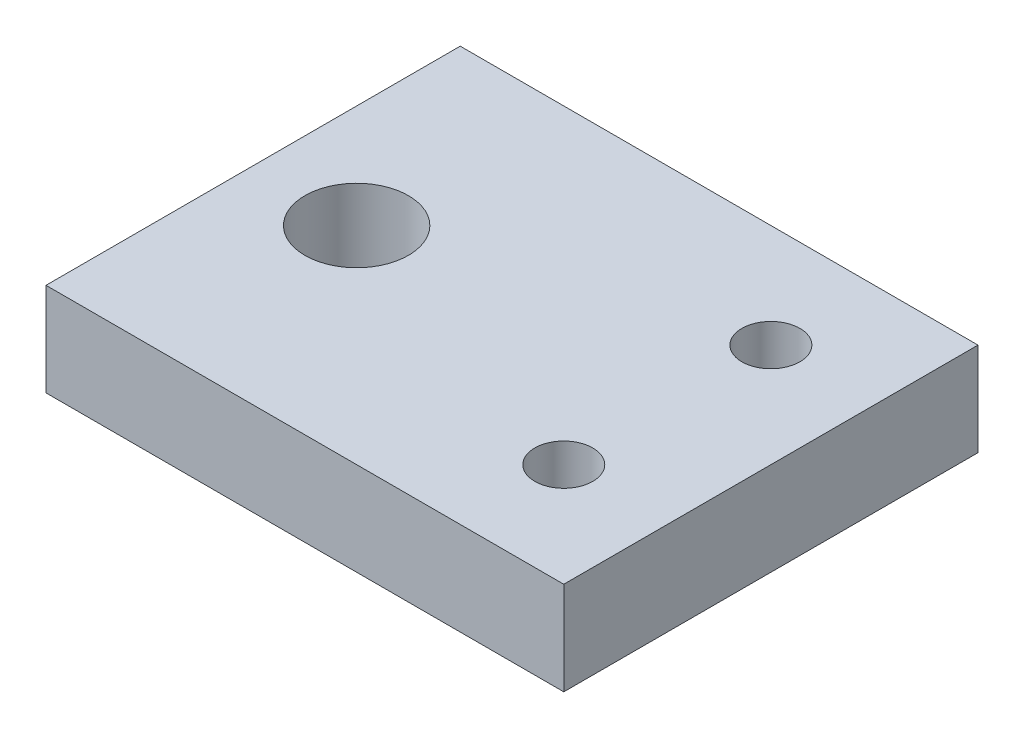
ISO-10303-21;
HEADER;
FILE_DESCRIPTION(('STEP AP214'),'2;1');
FILE_NAME('part.step','',(''),(''),'','','');
FILE_SCHEMA(('AUTOMOTIVE_DESIGN { 1 0 10303 214 1 1 1 1 }'));
ENDSEC;
DATA;
#1=APPLICATION_CONTEXT('core data for automotive mechanical design processes');
#2=APPLICATION_PROTOCOL_DEFINITION('international standard','automotive_design',2000,#1);
#3=PRODUCT_CONTEXT('',#1,'mechanical');
#4=PRODUCT('Part','Part','',(#3));
#5=PRODUCT_RELATED_PRODUCT_CATEGORY('part','',(#4));
#6=PRODUCT_DEFINITION_FORMATION('','',#4);
#7=PRODUCT_DEFINITION_CONTEXT('part definition',#1,'design');
#8=PRODUCT_DEFINITION('design','',#6,#7);
#9=PRODUCT_DEFINITION_SHAPE('','',#8);
#10=(LENGTH_UNIT() NAMED_UNIT(*) SI_UNIT(.MILLI.,.METRE.));
#11=(NAMED_UNIT(*) PLANE_ANGLE_UNIT() SI_UNIT($,.RADIAN.));
#12=(NAMED_UNIT(*) SI_UNIT($,.STERADIAN.) SOLID_ANGLE_UNIT());
#13=UNCERTAINTY_MEASURE_WITH_UNIT(LENGTH_MEASURE(1.E-05),#10,'distance_accuracy_value','');
#14=(GEOMETRIC_REPRESENTATION_CONTEXT(3) GLOBAL_UNCERTAINTY_ASSIGNED_CONTEXT((#13)) GLOBAL_UNIT_ASSIGNED_CONTEXT((#10,
#11,#12)) REPRESENTATION_CONTEXT('',''));
#15=CARTESIAN_POINT('',(0.,0.,0.));
#16=DIRECTION('',(0.,0.,1.));
#17=DIRECTION('',(1.,0.,0.));
#18=AXIS2_PLACEMENT_3D('',#15,#16,#17);
#19=CARTESIAN_POINT('',(0.,4.5,0.));
#20=DIRECTION('',(-1.,0.,0.));
#21=DIRECTION('',(0.,0.,1.));
#22=AXIS2_PLACEMENT_3D('',#19,#20,#21);
#23=PLANE('',#22);
#24=DIRECTION('',(0.,0.,-1.));
#25=VECTOR('',#24,1.);
#26=CARTESIAN_POINT('',(0.,0.,0.));
#27=LINE('',#26,#25);
#28=CARTESIAN_POINT('',(0.,0.,0.));
#29=VERTEX_POINT('',#28);
#30=CARTESIAN_POINT('',(0.,0.,-20.));
#31=VERTEX_POINT('',#30);
#32=EDGE_CURVE('E99',#29,#31,#27,.T.);
#33=ORIENTED_EDGE('',*,*,#32,.F.);
#34=DIRECTION('',(0.,-1.,0.));
#35=VECTOR('',#34,1.);
#36=CARTESIAN_POINT('',(0.,4.5,0.));
#37=LINE('',#36,#35);
#38=CARTESIAN_POINT('',(0.,4.5,0.));
#39=VERTEX_POINT('',#38);
#40=EDGE_CURVE('E11',#39,#29,#37,.T.);
#41=ORIENTED_EDGE('',*,*,#40,.F.);
#42=DIRECTION('',(0.,0.,-1.));
#43=VECTOR('',#42,1.);
#44=CARTESIAN_POINT('',(0.,4.5,0.));
#45=LINE('',#44,#43);
#46=CARTESIAN_POINT('',(0.,4.5,-20.));
#47=VERTEX_POINT('',#46);
#48=EDGE_CURVE('E93',#39,#47,#45,.T.);
#49=ORIENTED_EDGE('',*,*,#48,.T.);
#50=DIRECTION('',(0.,-1.,0.));
#51=VECTOR('',#50,1.);
#52=CARTESIAN_POINT('',(0.,4.5,-20.));
#53=LINE('',#52,#51);
#54=EDGE_CURVE('E36',#47,#31,#53,.T.);
#55=ORIENTED_EDGE('',*,*,#54,.T.);
#56=EDGE_LOOP('',(#33,#41,#49,#55));
#57=FACE_BOUND('',#56,.T.);
#58=ADVANCED_FACE('F33',(#57),#23,.T.);
#59=CARTESIAN_POINT('',(0.,4.5,0.));
#60=DIRECTION('',(0.,0.,-1.));
#61=DIRECTION('',(-1.,0.,0.));
#62=AXIS2_PLACEMENT_3D('',#59,#60,#61);
#63=PLANE('',#62);
#64=DIRECTION('',(1.,0.,0.));
#65=VECTOR('',#64,1.);
#66=CARTESIAN_POINT('',(0.,0.,0.));
#67=LINE('',#66,#65);
#68=CARTESIAN_POINT('',(25.,0.,0.));
#69=VERTEX_POINT('',#68);
#70=EDGE_CURVE('E66',#29,#69,#67,.T.);
#71=ORIENTED_EDGE('',*,*,#70,.T.);
#72=DIRECTION('',(0.,-1.,0.));
#73=VECTOR('',#72,1.);
#74=CARTESIAN_POINT('',(25.,4.5,0.));
#75=LINE('',#74,#73);
#76=CARTESIAN_POINT('',(25.,4.5,0.));
#77=VERTEX_POINT('',#76);
#78=EDGE_CURVE('E42',#77,#69,#75,.T.);
#79=ORIENTED_EDGE('',*,*,#78,.F.);
#80=DIRECTION('',(1.,0.,0.));
#81=VECTOR('',#80,1.);
#82=CARTESIAN_POINT('',(0.,4.5,0.));
#83=LINE('',#82,#81);
#84=EDGE_CURVE('E83',#39,#77,#83,.T.);
#85=ORIENTED_EDGE('',*,*,#84,.F.);
#86=ORIENTED_EDGE('',*,*,#40,.T.);
#87=EDGE_LOOP('',(#71,#79,#85,#86));
#88=FACE_BOUND('',#87,.T.);
#89=ADVANCED_FACE('F110',(#88),#63,.F.);
#90=CARTESIAN_POINT('',(25.,4.5,0.));
#91=DIRECTION('',(-1.,0.,0.));
#92=DIRECTION('',(0.,0.,1.));
#93=AXIS2_PLACEMENT_3D('',#90,#91,#92);
#94=PLANE('',#93);
#95=DIRECTION('',(0.,0.,-1.));
#96=VECTOR('',#95,1.);
#97=CARTESIAN_POINT('',(25.,0.,0.));
#98=LINE('',#97,#96);
#99=CARTESIAN_POINT('',(25.,0.,-20.));
#100=VERTEX_POINT('',#99);
#101=EDGE_CURVE('E90',#69,#100,#98,.T.);
#102=ORIENTED_EDGE('',*,*,#101,.T.);
#103=DIRECTION('',(0.,-1.,0.));
#104=VECTOR('',#103,1.);
#105=CARTESIAN_POINT('',(25.,4.5,-20.));
#106=LINE('',#105,#104);
#107=CARTESIAN_POINT('',(25.,4.5,-20.));
#108=VERTEX_POINT('',#107);
#109=EDGE_CURVE('E87',#108,#100,#106,.T.);
#110=ORIENTED_EDGE('',*,*,#109,.F.);
#111=DIRECTION('',(0.,0.,-1.));
#112=VECTOR('',#111,1.);
#113=CARTESIAN_POINT('',(25.,4.5,0.));
#114=LINE('',#113,#112);
#115=EDGE_CURVE('E78',#77,#108,#114,.T.);
#116=ORIENTED_EDGE('',*,*,#115,.F.);
#117=ORIENTED_EDGE('',*,*,#78,.T.);
#118=EDGE_LOOP('',(#102,#110,#116,#117));
#119=FACE_BOUND('',#118,.T.);
#120=ADVANCED_FACE('F88',(#119),#94,.F.);
#121=CARTESIAN_POINT('',(0.,4.5,-20.));
#122=DIRECTION('',(0.,0.,-1.));
#123=DIRECTION('',(-1.,0.,0.));
#124=AXIS2_PLACEMENT_3D('',#121,#122,#123);
#125=PLANE('',#124);
#126=DIRECTION('',(1.,0.,0.));
#127=VECTOR('',#126,1.);
#128=CARTESIAN_POINT('',(0.,0.,-20.));
#129=LINE('',#128,#127);
#130=EDGE_CURVE('E102',#31,#100,#129,.T.);
#131=ORIENTED_EDGE('',*,*,#130,.F.);
#132=ORIENTED_EDGE('',*,*,#54,.F.);
#133=DIRECTION('',(1.,0.,0.));
#134=VECTOR('',#133,1.);
#135=CARTESIAN_POINT('',(0.,4.5,-20.));
#136=LINE('',#135,#134);
#137=EDGE_CURVE('E82',#47,#108,#136,.T.);
#138=ORIENTED_EDGE('',*,*,#137,.T.);
#139=ORIENTED_EDGE('',*,*,#109,.T.);
#140=EDGE_LOOP('',(#131,#132,#138,#139));
#141=FACE_BOUND('',#140,.T.);
#142=ADVANCED_FACE('F92',(#141),#125,.T.);
#143=CARTESIAN_POINT('',(0.,4.5,0.));
#144=DIRECTION('',(0.,-1.,0.));
#145=DIRECTION('',(0.,0.,-1.));
#146=AXIS2_PLACEMENT_3D('',#143,#144,#145);
#147=PLANE('',#146);
#148=CARTESIAN_POINT('',(20.,4.5,-5.));
#149=DIRECTION('',(0.,1.,0.));
#150=DIRECTION('',(0.,0.,1.));
#151=AXIS2_PLACEMENT_3D('',#148,#149,#150);
#152=CIRCLE('',#151,1.4);
#153=CARTESIAN_POINT('',(20.,4.5,-3.6));
#154=VERTEX_POINT('',#153);
#155=EDGE_CURVE('E148',#154,#154,#152,.T.);
#156=ORIENTED_EDGE('',*,*,#155,.F.);
#157=EDGE_LOOP('',(#156));
#158=FACE_BOUND('',#157,.T.);
#159=CARTESIAN_POINT('',(5.,4.5,-10.));
#160=DIRECTION('',(0.,1.,0.));
#161=DIRECTION('',(0.,0.,1.));
#162=AXIS2_PLACEMENT_3D('',#159,#160,#161);
#163=CIRCLE('',#162,2.5);
#164=CARTESIAN_POINT('',(5.,4.5,-7.5));
#165=VERTEX_POINT('',#164);
#166=EDGE_CURVE('E152',#165,#165,#163,.T.);
#167=ORIENTED_EDGE('',*,*,#166,.F.);
#168=EDGE_LOOP('',(#167));
#169=FACE_BOUND('',#168,.T.);
#170=CARTESIAN_POINT('',(20.,4.5,-15.));
#171=DIRECTION('',(0.,1.,0.));
#172=DIRECTION('',(0.,0.,1.));
#173=AXIS2_PLACEMENT_3D('',#170,#171,#172);
#174=CIRCLE('',#173,1.4);
#175=CARTESIAN_POINT('',(20.,4.5,-13.6));
#176=VERTEX_POINT('',#175);
#177=EDGE_CURVE('E103',#176,#176,#174,.T.);
#178=ORIENTED_EDGE('',*,*,#177,.F.);
#179=EDGE_LOOP('',(#178));
#180=FACE_BOUND('',#179,.T.);
#181=ORIENTED_EDGE('',*,*,#48,.F.);
#182=ORIENTED_EDGE('',*,*,#84,.T.);
#183=ORIENTED_EDGE('',*,*,#115,.T.);
#184=ORIENTED_EDGE('',*,*,#137,.F.);
#185=EDGE_LOOP('',(#181,#182,#183,#184));
#186=FACE_BOUND('',#185,.T.);
#187=ADVANCED_FACE('F81',(#158,#169,#180,#186),#147,.F.);
#188=CARTESIAN_POINT('',(0.,0.,0.));
#189=DIRECTION('',(0.,-1.,0.));
#190=DIRECTION('',(0.,0.,-1.));
#191=AXIS2_PLACEMENT_3D('',#188,#189,#190);
#192=PLANE('',#191);
#193=CARTESIAN_POINT('',(20.,0.,-5.));
#194=DIRECTION('',(0.,1.,0.));
#195=DIRECTION('',(0.,0.,1.));
#196=AXIS2_PLACEMENT_3D('',#193,#194,#195);
#197=CIRCLE('',#196,1.4);
#198=CARTESIAN_POINT('',(20.,0.,-3.6));
#199=VERTEX_POINT('',#198);
#200=EDGE_CURVE('E151',#199,#199,#197,.T.);
#201=ORIENTED_EDGE('',*,*,#200,.T.);
#202=EDGE_LOOP('',(#201));
#203=FACE_BOUND('',#202,.T.);
#204=CARTESIAN_POINT('',(5.,0.,-10.));
#205=DIRECTION('',(0.,1.,0.));
#206=DIRECTION('',(0.,0.,1.));
#207=AXIS2_PLACEMENT_3D('',#204,#205,#206);
#208=CIRCLE('',#207,2.5);
#209=CARTESIAN_POINT('',(5.,0.,-7.5));
#210=VERTEX_POINT('',#209);
#211=EDGE_CURVE('E155',#210,#210,#208,.T.);
#212=ORIENTED_EDGE('',*,*,#211,.T.);
#213=EDGE_LOOP('',(#212));
#214=FACE_BOUND('',#213,.T.);
#215=CARTESIAN_POINT('',(20.,0.,-15.));
#216=DIRECTION('',(0.,1.,0.));
#217=DIRECTION('',(0.,0.,1.));
#218=AXIS2_PLACEMENT_3D('',#215,#216,#217);
#219=CIRCLE('',#218,1.4);
#220=CARTESIAN_POINT('',(20.,0.,-13.6));
#221=VERTEX_POINT('',#220);
#222=EDGE_CURVE('E160',#221,#221,#219,.T.);
#223=ORIENTED_EDGE('',*,*,#222,.T.);
#224=EDGE_LOOP('',(#223));
#225=FACE_BOUND('',#224,.T.);
#226=ORIENTED_EDGE('',*,*,#32,.T.);
#227=ORIENTED_EDGE('',*,*,#130,.T.);
#228=ORIENTED_EDGE('',*,*,#101,.F.);
#229=ORIENTED_EDGE('',*,*,#70,.F.);
#230=EDGE_LOOP('',(#226,#227,#228,#229));
#231=FACE_BOUND('',#230,.T.);
#232=ADVANCED_FACE('F108',(#203,#214,#225,#231),#192,.T.);
#233=CARTESIAN_POINT('',(20.,4.5,-15.));
#234=DIRECTION('',(0.,-1.,0.));
#235=DIRECTION('',(0.,0.,-1.));
#236=AXIS2_PLACEMENT_3D('',#233,#234,#235);
#237=CYLINDRICAL_SURFACE('',#236,1.4);
#238=ORIENTED_EDGE('',*,*,#177,.T.);
#239=EDGE_LOOP('',(#238));
#240=FACE_BOUND('',#239,.T.);
#241=ORIENTED_EDGE('',*,*,#222,.F.);
#242=EDGE_LOOP('',(#241));
#243=FACE_BOUND('',#242,.T.);
#244=ADVANCED_FACE('F129',(#240,#243),#237,.F.);
#245=CARTESIAN_POINT('',(5.,4.5,-10.));
#246=DIRECTION('',(0.,-1.,0.));
#247=DIRECTION('',(0.,0.,-1.));
#248=AXIS2_PLACEMENT_3D('',#245,#246,#247);
#249=CYLINDRICAL_SURFACE('',#248,2.5);
#250=ORIENTED_EDGE('',*,*,#166,.T.);
#251=EDGE_LOOP('',(#250));
#252=FACE_BOUND('',#251,.T.);
#253=ORIENTED_EDGE('',*,*,#211,.F.);
#254=EDGE_LOOP('',(#253));
#255=FACE_BOUND('',#254,.T.);
#256=ADVANCED_FACE('F136',(#252,#255),#249,.F.);
#257=CARTESIAN_POINT('',(20.,4.5,-5.));
#258=DIRECTION('',(0.,-1.,0.));
#259=DIRECTION('',(0.,0.,-1.));
#260=AXIS2_PLACEMENT_3D('',#257,#258,#259);
#261=CYLINDRICAL_SURFACE('',#260,1.4);
#262=ORIENTED_EDGE('',*,*,#155,.T.);
#263=EDGE_LOOP('',(#262));
#264=FACE_BOUND('',#263,.T.);
#265=ORIENTED_EDGE('',*,*,#200,.F.);
#266=EDGE_LOOP('',(#265));
#267=FACE_BOUND('',#266,.T.);
#268=ADVANCED_FACE('F140',(#264,#267),#261,.F.);
#269=CLOSED_SHELL('',(#58,#89,#120,#142,#187,#232,#244,#256,#268));
#270=MANIFOLD_SOLID_BREP('B2',#269);
#271=ADVANCED_BREP_SHAPE_REPRESENTATION('',(#18,#270),#14);
#272=SHAPE_DEFINITION_REPRESENTATION(#9,#271);
ENDSEC;
END-ISO-10303-21;
